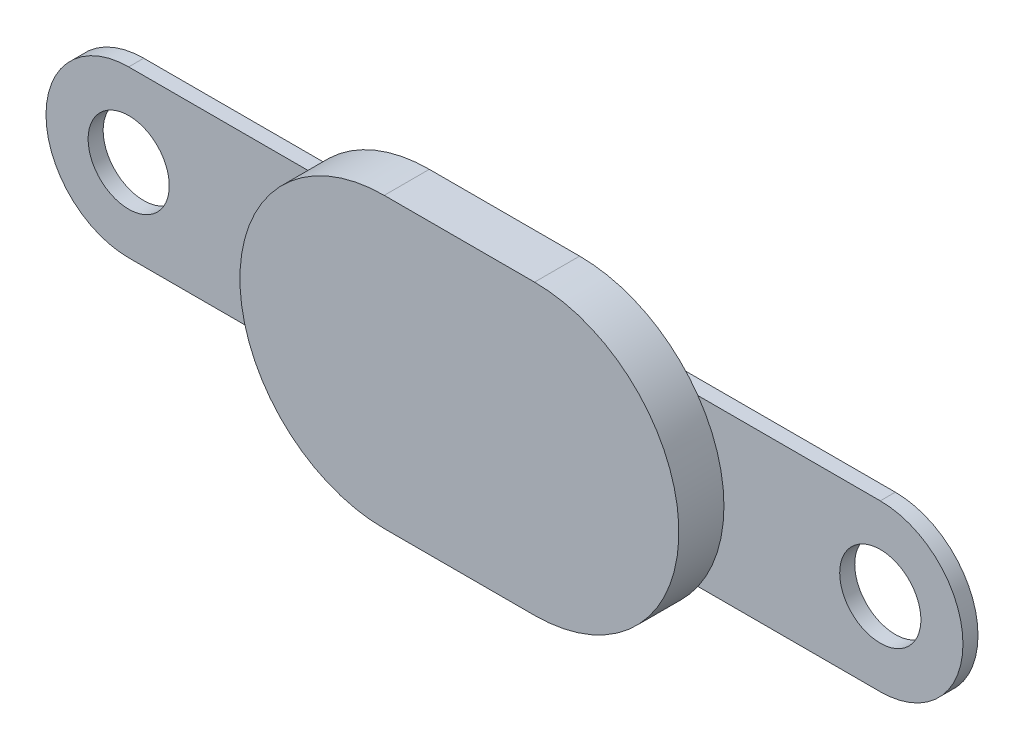
ISO-10303-21;
HEADER;
FILE_DESCRIPTION(('STEP AP214'),'2;1');
FILE_NAME('part.step','',(''),(''),'','','');
FILE_SCHEMA(('AUTOMOTIVE_DESIGN { 1 0 10303 214 1 1 1 1 }'));
ENDSEC;
DATA;
#1=APPLICATION_CONTEXT('core data for automotive mechanical design processes');
#2=APPLICATION_PROTOCOL_DEFINITION('international standard','automotive_design',2000,#1);
#3=PRODUCT_CONTEXT('',#1,'mechanical');
#4=PRODUCT('Part','Part','',(#3));
#5=PRODUCT_RELATED_PRODUCT_CATEGORY('part','',(#4));
#6=PRODUCT_DEFINITION_FORMATION('','',#4);
#7=PRODUCT_DEFINITION_CONTEXT('part definition',#1,'design');
#8=PRODUCT_DEFINITION('design','',#6,#7);
#9=PRODUCT_DEFINITION_SHAPE('','',#8);
#10=(LENGTH_UNIT() NAMED_UNIT(*) SI_UNIT(.MILLI.,.METRE.));
#11=(NAMED_UNIT(*) PLANE_ANGLE_UNIT() SI_UNIT($,.RADIAN.));
#12=(NAMED_UNIT(*) SI_UNIT($,.STERADIAN.) SOLID_ANGLE_UNIT());
#13=UNCERTAINTY_MEASURE_WITH_UNIT(LENGTH_MEASURE(1.E-05),#10,'distance_accuracy_value','');
#14=(GEOMETRIC_REPRESENTATION_CONTEXT(3) GLOBAL_UNCERTAINTY_ASSIGNED_CONTEXT((#13)) GLOBAL_UNIT_ASSIGNED_CONTEXT((#10,
#11,#12)) REPRESENTATION_CONTEXT('',''));
#15=CARTESIAN_POINT('',(0.,0.,0.));
#16=DIRECTION('',(0.,0.,1.));
#17=DIRECTION('',(1.,0.,0.));
#18=AXIS2_PLACEMENT_3D('',#15,#16,#17);
#19=CARTESIAN_POINT('',(-2.5,0.,0.));
#20=DIRECTION('',(0.,0.,1.));
#21=DIRECTION('',(1.,0.,0.));
#22=AXIS2_PLACEMENT_3D('',#19,#20,#21);
#23=PLANE('',#22);
#24=DIRECTION('',(-1.,0.,0.));
#25=VECTOR('',#24,1.);
#26=CARTESIAN_POINT('',(0.,-2.75,0.));
#27=LINE('',#26,#25);
#28=CARTESIAN_POINT('',(6.43414539639805,-2.75,0.));
#29=VERTEX_POINT('',#28);
#30=CARTESIAN_POINT('',(-6.43414539639806,-2.74999999999999,0.));
#31=VERTEX_POINT('',#30);
#32=EDGE_CURVE('E47',#29,#31,#27,.T.);
#33=ORIENTED_EDGE('',*,*,#32,.F.);
#34=CARTESIAN_POINT('',(2.5,0.,0.));
#35=DIRECTION('',(0.,0.,1.));
#36=DIRECTION('',(1.,0.,0.));
#37=AXIS2_PLACEMENT_3D('',#34,#35,#36);
#38=CIRCLE('',#37,4.8);
#39=CARTESIAN_POINT('',(2.5,-4.8,0.));
#40=VERTEX_POINT('',#39);
#41=EDGE_CURVE('E194',#40,#29,#38,.T.);
#42=ORIENTED_EDGE('',*,*,#41,.F.);
#43=DIRECTION('',(1.,0.,0.));
#44=VECTOR('',#43,1.);
#45=CARTESIAN_POINT('',(-2.5,-4.8,0.));
#46=LINE('',#45,#44);
#47=CARTESIAN_POINT('',(-2.5,-4.8,0.));
#48=VERTEX_POINT('',#47);
#49=EDGE_CURVE('E191',#48,#40,#46,.T.);
#50=ORIENTED_EDGE('',*,*,#49,.F.);
#51=CARTESIAN_POINT('',(-2.5,0.,0.));
#52=DIRECTION('',(0.,0.,1.));
#53=DIRECTION('',(1.,0.,0.));
#54=AXIS2_PLACEMENT_3D('',#51,#52,#53);
#55=CIRCLE('',#54,4.8);
#56=EDGE_CURVE('E131',#31,#48,#55,.T.);
#57=ORIENTED_EDGE('',*,*,#56,.F.);
#58=EDGE_LOOP('',(#33,#42,#50,#57));
#59=FACE_BOUND('',#58,.T.);
#60=ADVANCED_FACE('F38',(#59),#23,.F.);
#61=CARTESIAN_POINT('',(-2.5,0.,1.5));
#62=DIRECTION('',(0.,0.,-1.));
#63=DIRECTION('',(-1.,0.,0.));
#64=AXIS2_PLACEMENT_3D('',#61,#62,#63);
#65=CYLINDRICAL_SURFACE('',#64,4.8);
#66=CARTESIAN_POINT('',(-2.5,4.8,0.));
#67=VERTEX_POINT('',#66);
#68=CARTESIAN_POINT('',(-6.43414539639805,2.75,0.));
#69=VERTEX_POINT('',#68);
#70=EDGE_CURVE('E188',#67,#69,#55,.T.);
#71=ORIENTED_EDGE('',*,*,#70,.T.);
#72=EDGE_CURVE('E192',#69,#31,#55,.T.);
#73=ORIENTED_EDGE('',*,*,#72,.T.);
#74=ORIENTED_EDGE('',*,*,#56,.T.);
#75=DIRECTION('',(0.,0.,-1.));
#76=VECTOR('',#75,1.);
#77=CARTESIAN_POINT('',(-2.5,-4.8,1.5));
#78=LINE('',#77,#76);
#79=CARTESIAN_POINT('',(-2.5,-4.8,1.5));
#80=VERTEX_POINT('',#79);
#81=EDGE_CURVE('E42',#80,#48,#78,.T.);
#82=ORIENTED_EDGE('',*,*,#81,.F.);
#83=CARTESIAN_POINT('',(-2.5,0.,1.5));
#84=DIRECTION('',(0.,0.,1.));
#85=DIRECTION('',(1.,0.,0.));
#86=AXIS2_PLACEMENT_3D('',#83,#84,#85);
#87=CIRCLE('',#86,4.8);
#88=CARTESIAN_POINT('',(-2.5,4.8,1.5));
#89=VERTEX_POINT('',#88);
#90=EDGE_CURVE('E177',#89,#80,#87,.T.);
#91=ORIENTED_EDGE('',*,*,#90,.F.);
#92=DIRECTION('',(0.,0.,-1.));
#93=VECTOR('',#92,1.);
#94=CARTESIAN_POINT('',(-2.5,4.8,1.5));
#95=LINE('',#94,#93);
#96=EDGE_CURVE('E187',#89,#67,#95,.T.);
#97=ORIENTED_EDGE('',*,*,#96,.T.);
#98=EDGE_LOOP('',(#71,#73,#74,#82,#91,#97));
#99=FACE_BOUND('',#98,.T.);
#100=ADVANCED_FACE('F40',(#99),#65,.T.);
#101=CARTESIAN_POINT('',(-2.5,-4.8,1.5));
#102=DIRECTION('',(0.,1.,0.));
#103=DIRECTION('',(0.,0.,1.));
#104=AXIS2_PLACEMENT_3D('',#101,#102,#103);
#105=PLANE('',#104);
#106=ORIENTED_EDGE('',*,*,#49,.T.);
#107=DIRECTION('',(0.,0.,-1.));
#108=VECTOR('',#107,1.);
#109=CARTESIAN_POINT('',(2.5,-4.8,1.5));
#110=LINE('',#109,#108);
#111=CARTESIAN_POINT('',(2.5,-4.8,1.5));
#112=VERTEX_POINT('',#111);
#113=EDGE_CURVE('E202',#112,#40,#110,.T.);
#114=ORIENTED_EDGE('',*,*,#113,.F.);
#115=DIRECTION('',(1.,0.,0.));
#116=VECTOR('',#115,1.);
#117=CARTESIAN_POINT('',(-2.5,-4.8,1.5));
#118=LINE('',#117,#116);
#119=EDGE_CURVE('E180',#80,#112,#118,.T.);
#120=ORIENTED_EDGE('',*,*,#119,.F.);
#121=ORIENTED_EDGE('',*,*,#81,.T.);
#122=EDGE_LOOP('',(#106,#114,#120,#121));
#123=FACE_BOUND('',#122,.T.);
#124=ADVANCED_FACE('F238',(#123),#105,.F.);
#125=CARTESIAN_POINT('',(2.5,0.,1.5));
#126=DIRECTION('',(0.,0.,-1.));
#127=DIRECTION('',(-1.,0.,0.));
#128=AXIS2_PLACEMENT_3D('',#125,#126,#127);
#129=CYLINDRICAL_SURFACE('',#128,4.8);
#130=ORIENTED_EDGE('',*,*,#41,.T.);
#131=CARTESIAN_POINT('',(6.43414539639805,2.75,0.));
#132=VERTEX_POINT('',#131);
#133=EDGE_CURVE('E196',#29,#132,#38,.T.);
#134=ORIENTED_EDGE('',*,*,#133,.T.);
#135=CARTESIAN_POINT('',(2.5,4.8,0.));
#136=VERTEX_POINT('',#135);
#137=EDGE_CURVE('E56',#132,#136,#38,.T.);
#138=ORIENTED_EDGE('',*,*,#137,.T.);
#139=DIRECTION('',(0.,0.,-1.));
#140=VECTOR('',#139,1.);
#141=CARTESIAN_POINT('',(2.5,4.8,1.5));
#142=LINE('',#141,#140);
#143=CARTESIAN_POINT('',(2.5,4.8,1.5));
#144=VERTEX_POINT('',#143);
#145=EDGE_CURVE('E200',#144,#136,#142,.T.);
#146=ORIENTED_EDGE('',*,*,#145,.F.);
#147=CARTESIAN_POINT('',(2.5,0.,1.5));
#148=DIRECTION('',(0.,0.,1.));
#149=DIRECTION('',(1.,0.,0.));
#150=AXIS2_PLACEMENT_3D('',#147,#148,#149);
#151=CIRCLE('',#150,4.8);
#152=EDGE_CURVE('E183',#112,#144,#151,.T.);
#153=ORIENTED_EDGE('',*,*,#152,.F.);
#154=ORIENTED_EDGE('',*,*,#113,.T.);
#155=EDGE_LOOP('',(#130,#134,#138,#146,#153,#154));
#156=FACE_BOUND('',#155,.T.);
#157=ADVANCED_FACE('F228',(#156),#129,.T.);
#158=CARTESIAN_POINT('',(2.5,4.8,1.5));
#159=DIRECTION('',(0.,-1.,0.));
#160=DIRECTION('',(0.,0.,-1.));
#161=AXIS2_PLACEMENT_3D('',#158,#159,#160);
#162=PLANE('',#161);
#163=DIRECTION('',(-1.,0.,0.));
#164=VECTOR('',#163,1.);
#165=CARTESIAN_POINT('',(2.5,4.8,0.));
#166=LINE('',#165,#164);
#167=EDGE_CURVE('E181',#136,#67,#166,.T.);
#168=ORIENTED_EDGE('',*,*,#167,.T.);
#169=ORIENTED_EDGE('',*,*,#96,.F.);
#170=DIRECTION('',(-1.,0.,0.));
#171=VECTOR('',#170,1.);
#172=CARTESIAN_POINT('',(2.5,4.8,1.5));
#173=LINE('',#172,#171);
#174=EDGE_CURVE('E185',#144,#89,#173,.T.);
#175=ORIENTED_EDGE('',*,*,#174,.F.);
#176=ORIENTED_EDGE('',*,*,#145,.T.);
#177=EDGE_LOOP('',(#168,#169,#175,#176));
#178=FACE_BOUND('',#177,.T.);
#179=ADVANCED_FACE('F231',(#178),#162,.F.);
#180=CARTESIAN_POINT('',(-2.5,0.,1.5));
#181=DIRECTION('',(0.,0.,1.));
#182=DIRECTION('',(1.,0.,0.));
#183=AXIS2_PLACEMENT_3D('',#180,#181,#182);
#184=PLANE('',#183);
#185=ORIENTED_EDGE('',*,*,#90,.T.);
#186=ORIENTED_EDGE('',*,*,#119,.T.);
#187=ORIENTED_EDGE('',*,*,#152,.T.);
#188=ORIENTED_EDGE('',*,*,#174,.T.);
#189=EDGE_LOOP('',(#185,#186,#187,#188));
#190=FACE_BOUND('',#189,.T.);
#191=ADVANCED_FACE('F237',(#190),#184,.T.);
#192=ORIENTED_EDGE('',*,*,#137,.F.);
#193=DIRECTION('',(-1.,0.,0.));
#194=VECTOR('',#193,1.);
#195=CARTESIAN_POINT('',(0.,2.75,0.));
#196=LINE('',#195,#194);
#197=EDGE_CURVE('E11',#132,#69,#196,.T.);
#198=ORIENTED_EDGE('',*,*,#197,.T.);
#199=ORIENTED_EDGE('',*,*,#70,.F.);
#200=ORIENTED_EDGE('',*,*,#167,.F.);
#201=EDGE_LOOP('',(#192,#198,#199,#200));
#202=FACE_BOUND('',#201,.T.);
#203=ADVANCED_FACE('F233',(#202),#23,.F.);
#204=CARTESIAN_POINT('',(0.,0.,0.));
#205=DIRECTION('',(0.,0.,-1.));
#206=DIRECTION('',(-1.,0.,0.));
#207=AXIS2_PLACEMENT_3D('',#204,#205,#206);
#208=PLANE('',#207);
#209=ORIENTED_EDGE('',*,*,#72,.F.);
#210=CARTESIAN_POINT('',(-12.5,2.75,0.));
#211=VERTEX_POINT('',#210);
#212=EDGE_CURVE('E50',#69,#211,#196,.T.);
#213=ORIENTED_EDGE('',*,*,#212,.T.);
#214=CARTESIAN_POINT('',(-12.5,0.,0.));
#215=DIRECTION('',(0.,0.,-1.));
#216=DIRECTION('',(-1.,0.,0.));
#217=AXIS2_PLACEMENT_3D('',#214,#215,#216);
#218=CIRCLE('',#217,2.75);
#219=CARTESIAN_POINT('',(-12.5,-2.74999999999999,0.));
#220=VERTEX_POINT('',#219);
#221=EDGE_CURVE('E167',#211,#220,#218,.F.);
#222=ORIENTED_EDGE('',*,*,#221,.T.);
#223=EDGE_CURVE('E163',#31,#220,#27,.T.);
#224=ORIENTED_EDGE('',*,*,#223,.F.);
#225=EDGE_LOOP('',(#209,#213,#222,#224));
#226=FACE_BOUND('',#225,.T.);
#227=CARTESIAN_POINT('',(-12.5,0.,0.));
#228=DIRECTION('',(0.,0.,-1.));
#229=DIRECTION('',(-1.,0.,0.));
#230=AXIS2_PLACEMENT_3D('',#227,#228,#229);
#231=CIRCLE('',#230,1.35);
#232=CARTESIAN_POINT('',(-13.85,0.,0.));
#233=VERTEX_POINT('',#232);
#234=EDGE_CURVE('E149',#233,#233,#231,.T.);
#235=ORIENTED_EDGE('',*,*,#234,.T.);
#236=EDGE_LOOP('',(#235));
#237=FACE_BOUND('',#236,.T.);
#238=ADVANCED_FACE('F219',(#226,#237),#208,.F.);
#239=CARTESIAN_POINT('',(0.,2.75,-0.5));
#240=DIRECTION('',(0.,1.,0.));
#241=DIRECTION('',(0.,0.,1.));
#242=AXIS2_PLACEMENT_3D('',#239,#240,#241);
#243=PLANE('',#242);
#244=CARTESIAN_POINT('',(12.5,2.75,0.));
#245=VERTEX_POINT('',#244);
#246=EDGE_CURVE('E49',#245,#132,#196,.T.);
#247=ORIENTED_EDGE('',*,*,#246,.F.);
#248=DIRECTION('',(0.,0.,1.));
#249=VECTOR('',#248,1.);
#250=CARTESIAN_POINT('',(12.5,2.75,-0.5));
#251=LINE('',#250,#249);
#252=CARTESIAN_POINT('',(12.5,2.75,-0.5));
#253=VERTEX_POINT('',#252);
#254=EDGE_CURVE('E119',#253,#245,#251,.T.);
#255=ORIENTED_EDGE('',*,*,#254,.F.);
#256=DIRECTION('',(-1.,0.,0.));
#257=VECTOR('',#256,1.);
#258=CARTESIAN_POINT('',(0.,2.75,-0.5));
#259=LINE('',#258,#257);
#260=CARTESIAN_POINT('',(-12.5,2.75,-0.5));
#261=VERTEX_POINT('',#260);
#262=EDGE_CURVE('E124',#253,#261,#259,.T.);
#263=ORIENTED_EDGE('',*,*,#262,.T.);
#264=DIRECTION('',(0.,0.,1.));
#265=VECTOR('',#264,1.);
#266=CARTESIAN_POINT('',(-12.5,2.75,-0.5));
#267=LINE('',#266,#265);
#268=EDGE_CURVE('E157',#261,#211,#267,.T.);
#269=ORIENTED_EDGE('',*,*,#268,.T.);
#270=ORIENTED_EDGE('',*,*,#212,.F.);
#271=ORIENTED_EDGE('',*,*,#197,.F.);
#272=EDGE_LOOP('',(#247,#255,#263,#269,#270,#271));
#273=FACE_BOUND('',#272,.T.);
#274=ADVANCED_FACE('F121',(#273),#243,.T.);
#275=CARTESIAN_POINT('',(12.5,0.,-0.5));
#276=DIRECTION('',(0.,0.,1.));
#277=DIRECTION('',(1.,0.,0.));
#278=AXIS2_PLACEMENT_3D('',#275,#276,#277);
#279=CYLINDRICAL_SURFACE('',#278,2.75);
#280=CARTESIAN_POINT('',(12.5,0.,0.));
#281=DIRECTION('',(0.,0.,-1.));
#282=DIRECTION('',(-1.,0.,0.));
#283=AXIS2_PLACEMENT_3D('',#280,#281,#282);
#284=CIRCLE('',#283,2.75);
#285=CARTESIAN_POINT('',(12.5,-2.75,0.));
#286=VERTEX_POINT('',#285);
#287=EDGE_CURVE('E161',#245,#286,#284,.T.);
#288=ORIENTED_EDGE('',*,*,#287,.T.);
#289=DIRECTION('',(0.,0.,1.));
#290=VECTOR('',#289,1.);
#291=CARTESIAN_POINT('',(12.5,-2.75,-0.5));
#292=LINE('',#291,#290);
#293=CARTESIAN_POINT('',(12.5,-2.75,-0.5));
#294=VERTEX_POINT('',#293);
#295=EDGE_CURVE('E132',#294,#286,#292,.T.);
#296=ORIENTED_EDGE('',*,*,#295,.F.);
#297=CARTESIAN_POINT('',(12.5,0.,-0.5));
#298=DIRECTION('',(0.,0.,-1.));
#299=DIRECTION('',(-1.,0.,0.));
#300=AXIS2_PLACEMENT_3D('',#297,#298,#299);
#301=CIRCLE('',#300,2.75);
#302=EDGE_CURVE('E136',#253,#294,#301,.T.);
#303=ORIENTED_EDGE('',*,*,#302,.F.);
#304=ORIENTED_EDGE('',*,*,#254,.T.);
#305=EDGE_LOOP('',(#288,#296,#303,#304));
#306=FACE_BOUND('',#305,.T.);
#307=ADVANCED_FACE('F137',(#306),#279,.T.);
#308=CARTESIAN_POINT('',(0.,-2.75,-0.5));
#309=DIRECTION('',(0.,1.,0.));
#310=DIRECTION('',(-1.,0.,0.));
#311=AXIS2_PLACEMENT_3D('',#308,#309,#310);
#312=PLANE('',#311);
#313=EDGE_CURVE('E164',#286,#29,#27,.T.);
#314=ORIENTED_EDGE('',*,*,#313,.T.);
#315=ORIENTED_EDGE('',*,*,#32,.T.);
#316=ORIENTED_EDGE('',*,*,#223,.T.);
#317=DIRECTION('',(0.,0.,1.));
#318=VECTOR('',#317,1.);
#319=CARTESIAN_POINT('',(-12.5,-2.74999999999999,-0.5));
#320=LINE('',#319,#318);
#321=CARTESIAN_POINT('',(-12.5,-2.74999999999999,-0.5));
#322=VERTEX_POINT('',#321);
#323=EDGE_CURVE('E173',#322,#220,#320,.T.);
#324=ORIENTED_EDGE('',*,*,#323,.F.);
#325=DIRECTION('',(-1.,0.,0.));
#326=VECTOR('',#325,1.);
#327=CARTESIAN_POINT('',(0.,-2.75,-0.5));
#328=LINE('',#327,#326);
#329=EDGE_CURVE('E140',#294,#322,#328,.T.);
#330=ORIENTED_EDGE('',*,*,#329,.F.);
#331=ORIENTED_EDGE('',*,*,#295,.T.);
#332=EDGE_LOOP('',(#314,#315,#316,#324,#330,#331));
#333=FACE_BOUND('',#332,.T.);
#334=ADVANCED_FACE('F213',(#333),#312,.F.);
#335=CARTESIAN_POINT('',(-12.5,0.,-0.5));
#336=DIRECTION('',(0.,0.,1.));
#337=DIRECTION('',(1.,0.,0.));
#338=AXIS2_PLACEMENT_3D('',#335,#336,#337);
#339=CYLINDRICAL_SURFACE('',#338,2.75);
#340=ORIENTED_EDGE('',*,*,#221,.F.);
#341=ORIENTED_EDGE('',*,*,#268,.F.);
#342=CARTESIAN_POINT('',(-12.5,0.,-0.5));
#343=DIRECTION('',(0.,0.,-1.));
#344=DIRECTION('',(-1.,0.,0.));
#345=AXIS2_PLACEMENT_3D('',#342,#343,#344);
#346=CIRCLE('',#345,2.75);
#347=EDGE_CURVE('E145',#261,#322,#346,.F.);
#348=ORIENTED_EDGE('',*,*,#347,.T.);
#349=ORIENTED_EDGE('',*,*,#323,.T.);
#350=EDGE_LOOP('',(#340,#341,#348,#349));
#351=FACE_BOUND('',#350,.T.);
#352=ADVANCED_FACE('F218',(#351),#339,.T.);
#353=CARTESIAN_POINT('',(12.5,0.,-0.5));
#354=DIRECTION('',(0.,0.,1.));
#355=DIRECTION('',(1.,0.,0.));
#356=AXIS2_PLACEMENT_3D('',#353,#354,#355);
#357=CYLINDRICAL_SURFACE('',#356,1.35);
#358=CARTESIAN_POINT('',(12.5,0.,-0.5));
#359=DIRECTION('',(0.,0.,-1.));
#360=DIRECTION('',(-1.,0.,0.));
#361=AXIS2_PLACEMENT_3D('',#358,#359,#360);
#362=CIRCLE('',#361,1.35);
#363=CARTESIAN_POINT('',(11.15,0.,-0.5));
#364=VERTEX_POINT('',#363);
#365=EDGE_CURVE('E146',#364,#364,#362,.T.);
#366=ORIENTED_EDGE('',*,*,#365,.T.);
#367=EDGE_LOOP('',(#366));
#368=FACE_BOUND('',#367,.T.);
#369=CARTESIAN_POINT('',(12.5,0.,0.));
#370=DIRECTION('',(0.,0.,-1.));
#371=DIRECTION('',(-1.,0.,0.));
#372=AXIS2_PLACEMENT_3D('',#369,#370,#371);
#373=CIRCLE('',#372,1.35);
#374=CARTESIAN_POINT('',(11.15,0.,0.));
#375=VERTEX_POINT('',#374);
#376=EDGE_CURVE('E158',#375,#375,#373,.T.);
#377=ORIENTED_EDGE('',*,*,#376,.F.);
#378=EDGE_LOOP('',(#377));
#379=FACE_BOUND('',#378,.T.);
#380=ADVANCED_FACE('F257',(#368,#379),#357,.F.);
#381=CARTESIAN_POINT('',(-12.5,0.,-0.5));
#382=DIRECTION('',(0.,0.,1.));
#383=DIRECTION('',(1.,0.,0.));
#384=AXIS2_PLACEMENT_3D('',#381,#382,#383);
#385=CYLINDRICAL_SURFACE('',#384,1.35);
#386=CARTESIAN_POINT('',(-12.5,0.,-0.5));
#387=DIRECTION('',(0.,0.,-1.));
#388=DIRECTION('',(-1.,0.,0.));
#389=AXIS2_PLACEMENT_3D('',#386,#387,#388);
#390=CIRCLE('',#389,1.35);
#391=CARTESIAN_POINT('',(-13.85,0.,-0.5));
#392=VERTEX_POINT('',#391);
#393=EDGE_CURVE('E154',#392,#392,#390,.T.);
#394=ORIENTED_EDGE('',*,*,#393,.T.);
#395=EDGE_LOOP('',(#394));
#396=FACE_BOUND('',#395,.T.);
#397=ORIENTED_EDGE('',*,*,#234,.F.);
#398=EDGE_LOOP('',(#397));
#399=FACE_BOUND('',#398,.T.);
#400=ADVANCED_FACE('F260',(#396,#399),#385,.F.);
#401=CARTESIAN_POINT('',(0.,0.,-0.5));
#402=DIRECTION('',(0.,0.,-1.));
#403=DIRECTION('',(-1.,0.,0.));
#404=AXIS2_PLACEMENT_3D('',#401,#402,#403);
#405=PLANE('',#404);
#406=ORIENTED_EDGE('',*,*,#365,.F.);
#407=EDGE_LOOP('',(#406));
#408=FACE_BOUND('',#407,.T.);
#409=ORIENTED_EDGE('',*,*,#262,.F.);
#410=ORIENTED_EDGE('',*,*,#302,.T.);
#411=ORIENTED_EDGE('',*,*,#329,.T.);
#412=ORIENTED_EDGE('',*,*,#347,.F.);
#413=EDGE_LOOP('',(#409,#410,#411,#412));
#414=FACE_BOUND('',#413,.T.);
#415=ORIENTED_EDGE('',*,*,#393,.F.);
#416=EDGE_LOOP('',(#415));
#417=FACE_BOUND('',#416,.T.);
#418=ADVANCED_FACE('F142',(#408,#414,#417),#405,.T.);
#419=ORIENTED_EDGE('',*,*,#133,.F.);
#420=ORIENTED_EDGE('',*,*,#313,.F.);
#421=ORIENTED_EDGE('',*,*,#287,.F.);
#422=ORIENTED_EDGE('',*,*,#246,.T.);
#423=EDGE_LOOP('',(#419,#420,#421,#422));
#424=FACE_BOUND('',#423,.T.);
#425=ORIENTED_EDGE('',*,*,#376,.T.);
#426=EDGE_LOOP('',(#425));
#427=FACE_BOUND('',#426,.T.);
#428=ADVANCED_FACE('F225',(#424,#427),#208,.F.);
#429=CLOSED_SHELL('',(#60,#100,#124,#157,#179,#191,#203,#238,#274,#307,#334,#352,#380,#400,#418,#428));
#430=MANIFOLD_SOLID_BREP('B2',#429);
#431=ADVANCED_BREP_SHAPE_REPRESENTATION('',(#18,#430),#14);
#432=SHAPE_DEFINITION_REPRESENTATION(#9,#431);
ENDSEC;
END-ISO-10303-21;
